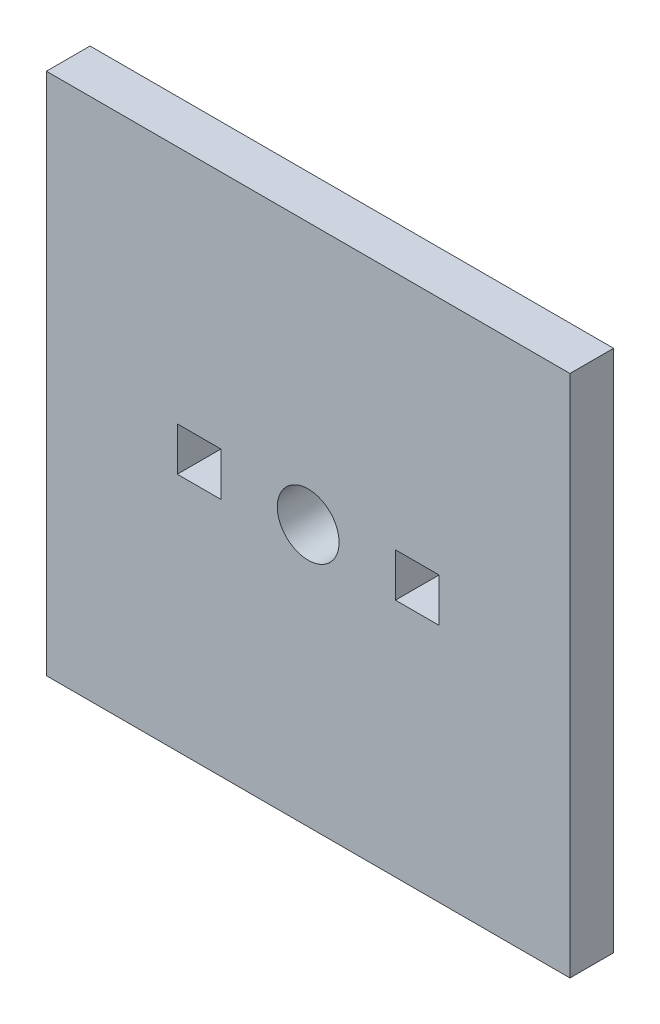
ISO-10303-21;
HEADER;
FILE_DESCRIPTION(('STEP AP214'),'2;1');
FILE_NAME('part.step','',(''),(''),'','','');
FILE_SCHEMA(('AUTOMOTIVE_DESIGN { 1 0 10303 214 1 1 1 1 }'));
ENDSEC;
DATA;
#1=APPLICATION_CONTEXT('core data for automotive mechanical design processes');
#2=APPLICATION_PROTOCOL_DEFINITION('international standard','automotive_design',2000,#1);
#3=PRODUCT_CONTEXT('',#1,'mechanical');
#4=PRODUCT('Part','Part','',(#3));
#5=PRODUCT_RELATED_PRODUCT_CATEGORY('part','',(#4));
#6=PRODUCT_DEFINITION_FORMATION('','',#4);
#7=PRODUCT_DEFINITION_CONTEXT('part definition',#1,'design');
#8=PRODUCT_DEFINITION('design','',#6,#7);
#9=PRODUCT_DEFINITION_SHAPE('','',#8);
#10=(LENGTH_UNIT() NAMED_UNIT(*) SI_UNIT(.MILLI.,.METRE.));
#11=(NAMED_UNIT(*) PLANE_ANGLE_UNIT() SI_UNIT($,.RADIAN.));
#12=(NAMED_UNIT(*) SI_UNIT($,.STERADIAN.) SOLID_ANGLE_UNIT());
#13=UNCERTAINTY_MEASURE_WITH_UNIT(LENGTH_MEASURE(1.E-05),#10,'distance_accuracy_value','');
#14=(GEOMETRIC_REPRESENTATION_CONTEXT(3) GLOBAL_UNCERTAINTY_ASSIGNED_CONTEXT((#13)) GLOBAL_UNIT_ASSIGNED_CONTEXT((#10,
#11,#12)) REPRESENTATION_CONTEXT('',''));
#15=CARTESIAN_POINT('',(0.,0.,0.));
#16=DIRECTION('',(0.,0.,1.));
#17=DIRECTION('',(1.,0.,0.));
#18=AXIS2_PLACEMENT_3D('',#15,#16,#17);
#19=CARTESIAN_POINT('',(19.05,19.05,3.175));
#20=DIRECTION('',(-1.,0.,0.));
#21=DIRECTION('',(0.,-1.,0.));
#22=AXIS2_PLACEMENT_3D('',#19,#20,#21);
#23=PLANE('',#22);
#24=DIRECTION('',(0.,1.,0.));
#25=VECTOR('',#24,1.);
#26=CARTESIAN_POINT('',(19.05,19.05,0.));
#27=LINE('',#26,#25);
#28=CARTESIAN_POINT('',(19.05,-19.05,0.));
#29=VERTEX_POINT('',#28);
#30=CARTESIAN_POINT('',(19.05,19.05,0.));
#31=VERTEX_POINT('',#30);
#32=EDGE_CURVE('E195',#29,#31,#27,.T.);
#33=ORIENTED_EDGE('',*,*,#32,.T.);
#34=DIRECTION('',(0.,0.,-1.));
#35=VECTOR('',#34,1.);
#36=CARTESIAN_POINT('',(19.05,19.05,3.175));
#37=LINE('',#36,#35);
#38=CARTESIAN_POINT('',(19.05,19.05,3.175));
#39=VERTEX_POINT('',#38);
#40=EDGE_CURVE('E11',#39,#31,#37,.T.);
#41=ORIENTED_EDGE('',*,*,#40,.F.);
#42=DIRECTION('',(0.,1.,0.));
#43=VECTOR('',#42,1.);
#44=CARTESIAN_POINT('',(19.05,19.05,3.175));
#45=LINE('',#44,#43);
#46=CARTESIAN_POINT('',(19.05,-19.05,3.175));
#47=VERTEX_POINT('',#46);
#48=EDGE_CURVE('E196',#47,#39,#45,.T.);
#49=ORIENTED_EDGE('',*,*,#48,.F.);
#50=DIRECTION('',(0.,0.,-1.));
#51=VECTOR('',#50,1.);
#52=CARTESIAN_POINT('',(19.05,-19.05,3.175));
#53=LINE('',#52,#51);
#54=EDGE_CURVE('E206',#47,#29,#53,.T.);
#55=ORIENTED_EDGE('',*,*,#54,.T.);
#56=EDGE_LOOP('',(#33,#41,#49,#55));
#57=FACE_BOUND('',#56,.T.);
#58=ADVANCED_FACE('F33',(#57),#23,.F.);
#59=CARTESIAN_POINT('',(-19.05,19.05,3.175));
#60=DIRECTION('',(0.,-1.,0.));
#61=DIRECTION('',(0.,0.,-1.));
#62=AXIS2_PLACEMENT_3D('',#59,#60,#61);
#63=PLANE('',#62);
#64=DIRECTION('',(-1.,0.,0.));
#65=VECTOR('',#64,1.);
#66=CARTESIAN_POINT('',(-19.05,19.05,0.));
#67=LINE('',#66,#65);
#68=CARTESIAN_POINT('',(-19.05,19.05,0.));
#69=VERTEX_POINT('',#68);
#70=EDGE_CURVE('E209',#31,#69,#67,.T.);
#71=ORIENTED_EDGE('',*,*,#70,.T.);
#72=DIRECTION('',(0.,0.,-1.));
#73=VECTOR('',#72,1.);
#74=CARTESIAN_POINT('',(-19.05,19.05,3.175));
#75=LINE('',#74,#73);
#76=CARTESIAN_POINT('',(-19.05,19.05,3.175));
#77=VERTEX_POINT('',#76);
#78=EDGE_CURVE('E40',#77,#69,#75,.T.);
#79=ORIENTED_EDGE('',*,*,#78,.F.);
#80=DIRECTION('',(-1.,0.,0.));
#81=VECTOR('',#80,1.);
#82=CARTESIAN_POINT('',(-19.05,19.05,3.175));
#83=LINE('',#82,#81);
#84=EDGE_CURVE('E199',#39,#77,#83,.T.);
#85=ORIENTED_EDGE('',*,*,#84,.F.);
#86=ORIENTED_EDGE('',*,*,#40,.T.);
#87=EDGE_LOOP('',(#71,#79,#85,#86));
#88=FACE_BOUND('',#87,.T.);
#89=ADVANCED_FACE('F238',(#88),#63,.F.);
#90=CARTESIAN_POINT('',(-19.05,19.05,3.175));
#91=DIRECTION('',(1.,0.,0.));
#92=DIRECTION('',(0.,1.,0.));
#93=AXIS2_PLACEMENT_3D('',#90,#91,#92);
#94=PLANE('',#93);
#95=DIRECTION('',(0.,-1.,0.));
#96=VECTOR('',#95,1.);
#97=CARTESIAN_POINT('',(-19.05,19.05,0.));
#98=LINE('',#97,#96);
#99=CARTESIAN_POINT('',(-19.05,-19.05,0.));
#100=VERTEX_POINT('',#99);
#101=EDGE_CURVE('E211',#69,#100,#98,.T.);
#102=ORIENTED_EDGE('',*,*,#101,.T.);
#103=DIRECTION('',(0.,0.,-1.));
#104=VECTOR('',#103,1.);
#105=CARTESIAN_POINT('',(-19.05,-19.05,3.175));
#106=LINE('',#105,#104);
#107=CARTESIAN_POINT('',(-19.05,-19.05,3.175));
#108=VERTEX_POINT('',#107);
#109=EDGE_CURVE('E216',#108,#100,#106,.T.);
#110=ORIENTED_EDGE('',*,*,#109,.F.);
#111=DIRECTION('',(0.,-1.,0.));
#112=VECTOR('',#111,1.);
#113=CARTESIAN_POINT('',(-19.05,19.05,3.175));
#114=LINE('',#113,#112);
#115=EDGE_CURVE('E202',#77,#108,#114,.T.);
#116=ORIENTED_EDGE('',*,*,#115,.F.);
#117=ORIENTED_EDGE('',*,*,#78,.T.);
#118=EDGE_LOOP('',(#102,#110,#116,#117));
#119=FACE_BOUND('',#118,.T.);
#120=ADVANCED_FACE('F223',(#119),#94,.F.);
#121=CARTESIAN_POINT('',(-19.05,-19.05,3.175));
#122=DIRECTION('',(0.,1.,0.));
#123=DIRECTION('',(0.,0.,1.));
#124=AXIS2_PLACEMENT_3D('',#121,#122,#123);
#125=PLANE('',#124);
#126=DIRECTION('',(1.,0.,0.));
#127=VECTOR('',#126,1.);
#128=CARTESIAN_POINT('',(-19.05,-19.05,0.));
#129=LINE('',#128,#127);
#130=EDGE_CURVE('E200',#100,#29,#129,.T.);
#131=ORIENTED_EDGE('',*,*,#130,.T.);
#132=ORIENTED_EDGE('',*,*,#54,.F.);
#133=DIRECTION('',(1.,0.,0.));
#134=VECTOR('',#133,1.);
#135=CARTESIAN_POINT('',(-19.05,-19.05,3.175));
#136=LINE('',#135,#134);
#137=EDGE_CURVE('E204',#108,#47,#136,.T.);
#138=ORIENTED_EDGE('',*,*,#137,.F.);
#139=ORIENTED_EDGE('',*,*,#109,.T.);
#140=EDGE_LOOP('',(#131,#132,#138,#139));
#141=FACE_BOUND('',#140,.T.);
#142=ADVANCED_FACE('F231',(#141),#125,.F.);
#143=CARTESIAN_POINT('',(0.,0.,3.175));
#144=DIRECTION('',(0.,0.,1.));
#145=DIRECTION('',(1.,0.,0.));
#146=AXIS2_PLACEMENT_3D('',#143,#144,#145);
#147=PLANE('',#146);
#148=DIRECTION('',(0.,1.,0.));
#149=VECTOR('',#148,1.);
#150=CARTESIAN_POINT('',(9.525,1.5875,3.175));
#151=LINE('',#150,#149);
#152=CARTESIAN_POINT('',(9.525,-1.5875,3.175));
#153=VERTEX_POINT('',#152);
#154=CARTESIAN_POINT('',(9.525,1.5875,3.175));
#155=VERTEX_POINT('',#154);
#156=EDGE_CURVE('E47',#153,#155,#151,.T.);
#157=ORIENTED_EDGE('',*,*,#156,.F.);
#158=DIRECTION('',(1.,0.,0.));
#159=VECTOR('',#158,1.);
#160=CARTESIAN_POINT('',(6.35,-1.5875,3.175));
#161=LINE('',#160,#159);
#162=CARTESIAN_POINT('',(6.35,-1.5875,3.175));
#163=VERTEX_POINT('',#162);
#164=EDGE_CURVE('E139',#163,#153,#161,.T.);
#165=ORIENTED_EDGE('',*,*,#164,.F.);
#166=DIRECTION('',(0.,-1.,0.));
#167=VECTOR('',#166,1.);
#168=CARTESIAN_POINT('',(6.35,1.5875,3.175));
#169=LINE('',#168,#167);
#170=CARTESIAN_POINT('',(6.35,1.5875,3.175));
#171=VERTEX_POINT('',#170);
#172=EDGE_CURVE('E142',#171,#163,#169,.T.);
#173=ORIENTED_EDGE('',*,*,#172,.F.);
#174=DIRECTION('',(-1.,0.,0.));
#175=VECTOR('',#174,1.);
#176=CARTESIAN_POINT('',(6.35,1.5875,3.175));
#177=LINE('',#176,#175);
#178=EDGE_CURVE('E148',#155,#171,#177,.T.);
#179=ORIENTED_EDGE('',*,*,#178,.F.);
#180=EDGE_LOOP('',(#157,#165,#173,#179));
#181=FACE_BOUND('',#180,.T.);
#182=DIRECTION('',(0.,1.,0.));
#183=VECTOR('',#182,1.);
#184=CARTESIAN_POINT('',(-6.35,1.5875,3.175));
#185=LINE('',#184,#183);
#186=CARTESIAN_POINT('',(-6.35,-1.5875,3.175));
#187=VERTEX_POINT('',#186);
#188=CARTESIAN_POINT('',(-6.35,1.5875,3.175));
#189=VERTEX_POINT('',#188);
#190=EDGE_CURVE('E154',#187,#189,#185,.T.);
#191=ORIENTED_EDGE('',*,*,#190,.F.);
#192=DIRECTION('',(1.,0.,0.));
#193=VECTOR('',#192,1.);
#194=CARTESIAN_POINT('',(-9.525,-1.5875,3.175));
#195=LINE('',#194,#193);
#196=CARTESIAN_POINT('',(-9.525,-1.5875,3.175));
#197=VERTEX_POINT('',#196);
#198=EDGE_CURVE('E162',#197,#187,#195,.T.);
#199=ORIENTED_EDGE('',*,*,#198,.F.);
#200=DIRECTION('',(0.,-1.,0.));
#201=VECTOR('',#200,1.);
#202=CARTESIAN_POINT('',(-9.525,1.5875,3.175));
#203=LINE('',#202,#201);
#204=CARTESIAN_POINT('',(-9.525,1.5875,3.175));
#205=VERTEX_POINT('',#204);
#206=EDGE_CURVE('E176',#205,#197,#203,.T.);
#207=ORIENTED_EDGE('',*,*,#206,.F.);
#208=DIRECTION('',(-1.,0.,0.));
#209=VECTOR('',#208,1.);
#210=CARTESIAN_POINT('',(-9.525,1.5875,3.175));
#211=LINE('',#210,#209);
#212=EDGE_CURVE('E173',#189,#205,#211,.T.);
#213=ORIENTED_EDGE('',*,*,#212,.F.);
#214=EDGE_LOOP('',(#191,#199,#207,#213));
#215=FACE_BOUND('',#214,.T.);
#216=CARTESIAN_POINT('',(0.,0.,3.175));
#217=DIRECTION('',(0.,0.,1.));
#218=DIRECTION('',(1.,0.,0.));
#219=AXIS2_PLACEMENT_3D('',#216,#217,#218);
#220=CIRCLE('',#219,2.2479);
#221=CARTESIAN_POINT('',(2.2479,0.,3.175));
#222=VERTEX_POINT('',#221);
#223=EDGE_CURVE('E183',#222,#222,#220,.T.);
#224=ORIENTED_EDGE('',*,*,#223,.F.);
#225=EDGE_LOOP('',(#224));
#226=FACE_BOUND('',#225,.T.);
#227=ORIENTED_EDGE('',*,*,#48,.T.);
#228=ORIENTED_EDGE('',*,*,#84,.T.);
#229=ORIENTED_EDGE('',*,*,#115,.T.);
#230=ORIENTED_EDGE('',*,*,#137,.T.);
#231=EDGE_LOOP('',(#227,#228,#229,#230));
#232=FACE_BOUND('',#231,.T.);
#233=ADVANCED_FACE('F237',(#181,#215,#226,#232),#147,.T.);
#234=CARTESIAN_POINT('',(0.,0.,0.));
#235=DIRECTION('',(0.,0.,1.));
#236=DIRECTION('',(1.,0.,0.));
#237=AXIS2_PLACEMENT_3D('',#234,#235,#236);
#238=PLANE('',#237);
#239=DIRECTION('',(1.,0.,0.));
#240=VECTOR('',#239,1.);
#241=CARTESIAN_POINT('',(6.35,-1.5875,0.));
#242=LINE('',#241,#240);
#243=CARTESIAN_POINT('',(6.35,-1.5875,0.));
#244=VERTEX_POINT('',#243);
#245=CARTESIAN_POINT('',(9.525,-1.5875,0.));
#246=VERTEX_POINT('',#245);
#247=EDGE_CURVE('E129',#244,#246,#242,.T.);
#248=ORIENTED_EDGE('',*,*,#247,.T.);
#249=DIRECTION('',(0.,1.,0.));
#250=VECTOR('',#249,1.);
#251=CARTESIAN_POINT('',(9.525,1.5875,0.));
#252=LINE('',#251,#250);
#253=CARTESIAN_POINT('',(9.525,1.5875,0.));
#254=VERTEX_POINT('',#253);
#255=EDGE_CURVE('E123',#246,#254,#252,.T.);
#256=ORIENTED_EDGE('',*,*,#255,.T.);
#257=DIRECTION('',(-1.,0.,0.));
#258=VECTOR('',#257,1.);
#259=CARTESIAN_POINT('',(6.35,1.5875,0.));
#260=LINE('',#259,#258);
#261=CARTESIAN_POINT('',(6.35,1.5875,0.));
#262=VERTEX_POINT('',#261);
#263=EDGE_CURVE('E132',#254,#262,#260,.T.);
#264=ORIENTED_EDGE('',*,*,#263,.T.);
#265=DIRECTION('',(0.,-1.,0.));
#266=VECTOR('',#265,1.);
#267=CARTESIAN_POINT('',(6.35,1.5875,0.));
#268=LINE('',#267,#266);
#269=EDGE_CURVE('E55',#262,#244,#268,.T.);
#270=ORIENTED_EDGE('',*,*,#269,.T.);
#271=EDGE_LOOP('',(#248,#256,#264,#270));
#272=FACE_BOUND('',#271,.T.);
#273=DIRECTION('',(1.,0.,0.));
#274=VECTOR('',#273,1.);
#275=CARTESIAN_POINT('',(-9.525,-1.5875,0.));
#276=LINE('',#275,#274);
#277=CARTESIAN_POINT('',(-9.525,-1.5875,0.));
#278=VERTEX_POINT('',#277);
#279=CARTESIAN_POINT('',(-6.35,-1.5875,0.));
#280=VERTEX_POINT('',#279);
#281=EDGE_CURVE('E168',#278,#280,#276,.T.);
#282=ORIENTED_EDGE('',*,*,#281,.T.);
#283=DIRECTION('',(0.,1.,0.));
#284=VECTOR('',#283,1.);
#285=CARTESIAN_POINT('',(-6.35,1.5875,0.));
#286=LINE('',#285,#284);
#287=CARTESIAN_POINT('',(-6.35,1.5875,0.));
#288=VERTEX_POINT('',#287);
#289=EDGE_CURVE('E158',#280,#288,#286,.T.);
#290=ORIENTED_EDGE('',*,*,#289,.T.);
#291=DIRECTION('',(-1.,0.,0.));
#292=VECTOR('',#291,1.);
#293=CARTESIAN_POINT('',(-9.525,1.5875,0.));
#294=LINE('',#293,#292);
#295=CARTESIAN_POINT('',(-9.525,1.5875,0.));
#296=VERTEX_POINT('',#295);
#297=EDGE_CURVE('E161',#288,#296,#294,.T.);
#298=ORIENTED_EDGE('',*,*,#297,.T.);
#299=DIRECTION('',(0.,-1.,0.));
#300=VECTOR('',#299,1.);
#301=CARTESIAN_POINT('',(-9.525,1.5875,0.));
#302=LINE('',#301,#300);
#303=EDGE_CURVE('E165',#296,#278,#302,.T.);
#304=ORIENTED_EDGE('',*,*,#303,.T.);
#305=EDGE_LOOP('',(#282,#290,#298,#304));
#306=FACE_BOUND('',#305,.T.);
#307=CARTESIAN_POINT('',(0.,0.,0.));
#308=DIRECTION('',(0.,0.,1.));
#309=DIRECTION('',(1.,0.,0.));
#310=AXIS2_PLACEMENT_3D('',#307,#308,#309);
#311=CIRCLE('',#310,2.2479);
#312=CARTESIAN_POINT('',(2.2479,0.,0.));
#313=VERTEX_POINT('',#312);
#314=EDGE_CURVE('E192',#313,#313,#311,.T.);
#315=ORIENTED_EDGE('',*,*,#314,.T.);
#316=EDGE_LOOP('',(#315));
#317=FACE_BOUND('',#316,.T.);
#318=ORIENTED_EDGE('',*,*,#32,.F.);
#319=ORIENTED_EDGE('',*,*,#130,.F.);
#320=ORIENTED_EDGE('',*,*,#101,.F.);
#321=ORIENTED_EDGE('',*,*,#70,.F.);
#322=EDGE_LOOP('',(#318,#319,#320,#321));
#323=FACE_BOUND('',#322,.T.);
#324=ADVANCED_FACE('F136',(#272,#306,#317,#323),#238,.F.);
#325=CARTESIAN_POINT('',(0.,0.,3.175));
#326=DIRECTION('',(0.,0.,1.));
#327=DIRECTION('',(1.,0.,0.));
#328=AXIS2_PLACEMENT_3D('',#325,#326,#327);
#329=CYLINDRICAL_SURFACE('',#328,2.2479);
#330=ORIENTED_EDGE('',*,*,#223,.T.);
#331=EDGE_LOOP('',(#330));
#332=FACE_BOUND('',#331,.T.);
#333=ORIENTED_EDGE('',*,*,#314,.F.);
#334=EDGE_LOOP('',(#333));
#335=FACE_BOUND('',#334,.T.);
#336=ADVANCED_FACE('F250',(#332,#335),#329,.F.);
#337=CARTESIAN_POINT('',(-6.35,1.5875,0.));
#338=DIRECTION('',(1.,0.,0.));
#339=DIRECTION('',(0.,0.,-1.));
#340=AXIS2_PLACEMENT_3D('',#337,#338,#339);
#341=PLANE('',#340);
#342=ORIENTED_EDGE('',*,*,#190,.T.);
#343=DIRECTION('',(0.,0.,1.));
#344=VECTOR('',#343,1.);
#345=CARTESIAN_POINT('',(-6.35,1.5875,0.));
#346=LINE('',#345,#344);
#347=EDGE_CURVE('E171',#288,#189,#346,.T.);
#348=ORIENTED_EDGE('',*,*,#347,.F.);
#349=ORIENTED_EDGE('',*,*,#289,.F.);
#350=DIRECTION('',(0.,0.,1.));
#351=VECTOR('',#350,1.);
#352=CARTESIAN_POINT('',(-6.35,-1.5875,0.));
#353=LINE('',#352,#351);
#354=EDGE_CURVE('E181',#280,#187,#353,.T.);
#355=ORIENTED_EDGE('',*,*,#354,.T.);
#356=EDGE_LOOP('',(#342,#348,#349,#355));
#357=FACE_BOUND('',#356,.T.);
#358=ADVANCED_FACE('F256',(#357),#341,.F.);
#359=CARTESIAN_POINT('',(-9.525,-1.5875,0.));
#360=DIRECTION('',(0.,-1.,0.));
#361=DIRECTION('',(0.,0.,-1.));
#362=AXIS2_PLACEMENT_3D('',#359,#360,#361);
#363=PLANE('',#362);
#364=ORIENTED_EDGE('',*,*,#198,.T.);
#365=ORIENTED_EDGE('',*,*,#354,.F.);
#366=ORIENTED_EDGE('',*,*,#281,.F.);
#367=DIRECTION('',(0.,0.,1.));
#368=VECTOR('',#367,1.);
#369=CARTESIAN_POINT('',(-9.525,-1.5875,0.));
#370=LINE('',#369,#368);
#371=EDGE_CURVE('E184',#278,#197,#370,.T.);
#372=ORIENTED_EDGE('',*,*,#371,.T.);
#373=EDGE_LOOP('',(#364,#365,#366,#372));
#374=FACE_BOUND('',#373,.T.);
#375=ADVANCED_FACE('F260',(#374),#363,.F.);
#376=CARTESIAN_POINT('',(-9.525,1.5875,0.));
#377=DIRECTION('',(-1.,0.,0.));
#378=DIRECTION('',(0.,0.,1.));
#379=AXIS2_PLACEMENT_3D('',#376,#377,#378);
#380=PLANE('',#379);
#381=ORIENTED_EDGE('',*,*,#206,.T.);
#382=ORIENTED_EDGE('',*,*,#371,.F.);
#383=ORIENTED_EDGE('',*,*,#303,.F.);
#384=DIRECTION('',(0.,0.,1.));
#385=VECTOR('',#384,1.);
#386=CARTESIAN_POINT('',(-9.525,1.5875,0.));
#387=LINE('',#386,#385);
#388=EDGE_CURVE('E186',#296,#205,#387,.T.);
#389=ORIENTED_EDGE('',*,*,#388,.T.);
#390=EDGE_LOOP('',(#381,#382,#383,#389));
#391=FACE_BOUND('',#390,.T.);
#392=ADVANCED_FACE('F265',(#391),#380,.F.);
#393=CARTESIAN_POINT('',(-9.525,1.5875,0.));
#394=DIRECTION('',(0.,1.,0.));
#395=DIRECTION('',(0.,0.,1.));
#396=AXIS2_PLACEMENT_3D('',#393,#394,#395);
#397=PLANE('',#396);
#398=ORIENTED_EDGE('',*,*,#212,.T.);
#399=ORIENTED_EDGE('',*,*,#388,.F.);
#400=ORIENTED_EDGE('',*,*,#297,.F.);
#401=ORIENTED_EDGE('',*,*,#347,.T.);
#402=EDGE_LOOP('',(#398,#399,#400,#401));
#403=FACE_BOUND('',#402,.T.);
#404=ADVANCED_FACE('F262',(#403),#397,.F.);
#405=CARTESIAN_POINT('',(9.525,1.5875,0.));
#406=DIRECTION('',(1.,0.,0.));
#407=DIRECTION('',(0.,0.,-1.));
#408=AXIS2_PLACEMENT_3D('',#405,#406,#407);
#409=PLANE('',#408);
#410=ORIENTED_EDGE('',*,*,#156,.T.);
#411=DIRECTION('',(0.,0.,1.));
#412=VECTOR('',#411,1.);
#413=CARTESIAN_POINT('',(9.525,1.5875,0.));
#414=LINE('',#413,#412);
#415=EDGE_CURVE('E119',#254,#155,#414,.T.);
#416=ORIENTED_EDGE('',*,*,#415,.F.);
#417=ORIENTED_EDGE('',*,*,#255,.F.);
#418=DIRECTION('',(0.,0.,1.));
#419=VECTOR('',#418,1.);
#420=CARTESIAN_POINT('',(9.525,-1.5875,0.));
#421=LINE('',#420,#419);
#422=EDGE_CURVE('E152',#246,#153,#421,.T.);
#423=ORIENTED_EDGE('',*,*,#422,.T.);
#424=EDGE_LOOP('',(#410,#416,#417,#423));
#425=FACE_BOUND('',#424,.T.);
#426=ADVANCED_FACE('F121',(#425),#409,.F.);
#427=CARTESIAN_POINT('',(6.35,-1.5875,0.));
#428=DIRECTION('',(0.,-1.,0.));
#429=DIRECTION('',(0.,0.,-1.));
#430=AXIS2_PLACEMENT_3D('',#427,#428,#429);
#431=PLANE('',#430);
#432=ORIENTED_EDGE('',*,*,#164,.T.);
#433=ORIENTED_EDGE('',*,*,#422,.F.);
#434=ORIENTED_EDGE('',*,*,#247,.F.);
#435=DIRECTION('',(0.,0.,1.));
#436=VECTOR('',#435,1.);
#437=CARTESIAN_POINT('',(6.35,-1.5875,0.));
#438=LINE('',#437,#436);
#439=EDGE_CURVE('E155',#244,#163,#438,.T.);
#440=ORIENTED_EDGE('',*,*,#439,.T.);
#441=EDGE_LOOP('',(#432,#433,#434,#440));
#442=FACE_BOUND('',#441,.T.);
#443=ADVANCED_FACE('F275',(#442),#431,.F.);
#444=CARTESIAN_POINT('',(6.35,1.5875,0.));
#445=DIRECTION('',(-1.,0.,0.));
#446=DIRECTION('',(0.,0.,1.));
#447=AXIS2_PLACEMENT_3D('',#444,#445,#446);
#448=PLANE('',#447);
#449=ORIENTED_EDGE('',*,*,#172,.T.);
#450=ORIENTED_EDGE('',*,*,#439,.F.);
#451=ORIENTED_EDGE('',*,*,#269,.F.);
#452=DIRECTION('',(0.,0.,1.));
#453=VECTOR('',#452,1.);
#454=CARTESIAN_POINT('',(6.35,1.5875,0.));
#455=LINE('',#454,#453);
#456=EDGE_CURVE('E128',#262,#171,#455,.T.);
#457=ORIENTED_EDGE('',*,*,#456,.T.);
#458=EDGE_LOOP('',(#449,#450,#451,#457));
#459=FACE_BOUND('',#458,.T.);
#460=ADVANCED_FACE('F278',(#459),#448,.F.);
#461=CARTESIAN_POINT('',(6.35,1.5875,0.));
#462=DIRECTION('',(0.,1.,0.));
#463=DIRECTION('',(0.,0.,1.));
#464=AXIS2_PLACEMENT_3D('',#461,#462,#463);
#465=PLANE('',#464);
#466=ORIENTED_EDGE('',*,*,#178,.T.);
#467=ORIENTED_EDGE('',*,*,#456,.F.);
#468=ORIENTED_EDGE('',*,*,#263,.F.);
#469=ORIENTED_EDGE('',*,*,#415,.T.);
#470=EDGE_LOOP('',(#466,#467,#468,#469));
#471=FACE_BOUND('',#470,.T.);
#472=ADVANCED_FACE('F133',(#471),#465,.F.);
#473=CLOSED_SHELL('',(#58,#89,#120,#142,#233,#324,#336,#358,#375,#392,#404,#426,#443,#460,#472));
#474=MANIFOLD_SOLID_BREP('B2',#473);
#475=ADVANCED_BREP_SHAPE_REPRESENTATION('',(#18,#474),#14);
#476=SHAPE_DEFINITION_REPRESENTATION(#9,#475);
ENDSEC;
END-ISO-10303-21;
